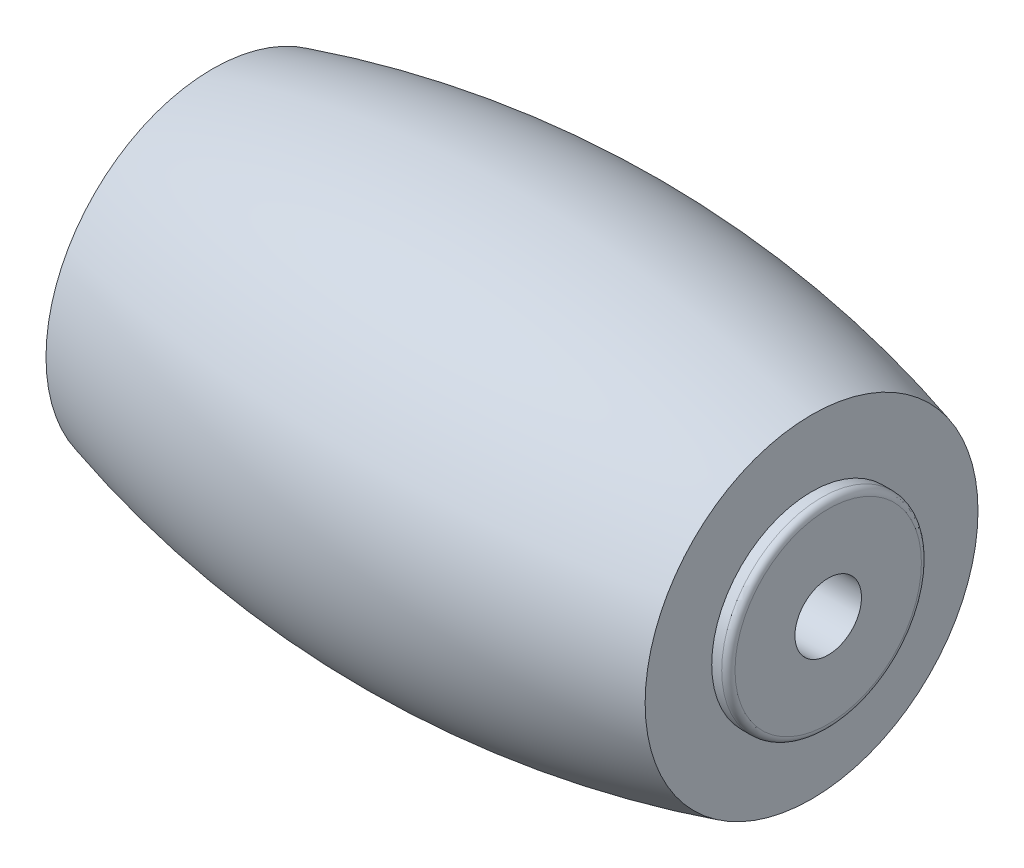
ISO-10303-21;
HEADER;
FILE_DESCRIPTION(('STEP AP214'),'2;1');
FILE_NAME('part.step','',(''),(''),'','','');
FILE_SCHEMA(('AUTOMOTIVE_DESIGN { 1 0 10303 214 1 1 1 1 }'));
ENDSEC;
DATA;
#1=APPLICATION_CONTEXT('core data for automotive mechanical design processes');
#2=APPLICATION_PROTOCOL_DEFINITION('international standard','automotive_design',2000,#1);
#3=PRODUCT_CONTEXT('',#1,'mechanical');
#4=PRODUCT('Part','Part','',(#3));
#5=PRODUCT_RELATED_PRODUCT_CATEGORY('part','',(#4));
#6=PRODUCT_DEFINITION_FORMATION('','',#4);
#7=PRODUCT_DEFINITION_CONTEXT('part definition',#1,'design');
#8=PRODUCT_DEFINITION('design','',#6,#7);
#9=PRODUCT_DEFINITION_SHAPE('','',#8);
#10=(LENGTH_UNIT() NAMED_UNIT(*) SI_UNIT(.MILLI.,.METRE.));
#11=(NAMED_UNIT(*) PLANE_ANGLE_UNIT() SI_UNIT($,.RADIAN.));
#12=(NAMED_UNIT(*) SI_UNIT($,.STERADIAN.) SOLID_ANGLE_UNIT());
#13=UNCERTAINTY_MEASURE_WITH_UNIT(LENGTH_MEASURE(1.E-05),#10,'distance_accuracy_value','');
#14=(GEOMETRIC_REPRESENTATION_CONTEXT(3) GLOBAL_UNCERTAINTY_ASSIGNED_CONTEXT((#13)) GLOBAL_UNIT_ASSIGNED_CONTEXT((#10,
#11,#12)) REPRESENTATION_CONTEXT('',''));
#15=CARTESIAN_POINT('',(0.,0.,0.));
#16=DIRECTION('',(0.,0.,1.));
#17=DIRECTION('',(1.,0.,0.));
#18=AXIS2_PLACEMENT_3D('',#15,#16,#17);
#19=CARTESIAN_POINT('',(8.05263157894736,0.,0.));
#20=DIRECTION('',(1.,0.,0.));
#21=DIRECTION('',(0.,0.,-1.));
#22=AXIS2_PLACEMENT_3D('',#19,#20,#21);
#23=PLANE('',#22);
#24=CARTESIAN_POINT('',(8.05263157894736,0.,0.));
#25=DIRECTION('',(1.,0.,0.));
#26=DIRECTION('',(0.,0.,-1.));
#27=AXIS2_PLACEMENT_3D('',#24,#25,#26);
#28=CIRCLE('',#27,2.68421052631579);
#29=CARTESIAN_POINT('',(8.05263157894736,0.,-2.68421052631579));
#30=VERTEX_POINT('',#29);
#31=EDGE_CURVE('E64',#30,#30,#28,.T.);
#32=ORIENTED_EDGE('',*,*,#31,.F.);
#33=EDGE_LOOP('',(#32));
#34=FACE_BOUND('',#33,.T.);
#35=CARTESIAN_POINT('',(8.05263157894735,0.,0.));
#36=DIRECTION('',(1.,0.,0.));
#37=DIRECTION('',(0.,0.,-1.));
#38=AXIS2_PLACEMENT_3D('',#35,#36,#37);
#39=CIRCLE('',#38,4.47368421052632);
#40=CARTESIAN_POINT('',(8.05263157894735,0.,-4.47368421052632));
#41=VERTEX_POINT('',#40);
#42=EDGE_CURVE('E69',#41,#41,#39,.T.);
#43=ORIENTED_EDGE('',*,*,#42,.T.);
#44=EDGE_LOOP('',(#43));
#45=FACE_BOUND('',#44,.T.);
#46=ADVANCED_FACE('F40',(#34,#45),#23,.T.);
#47=CARTESIAN_POINT('',(-8.05263157894737,0.,0.));
#48=DIRECTION('',(-1.,0.,0.));
#49=DIRECTION('',(0.,0.,1.));
#50=AXIS2_PLACEMENT_3D('',#47,#48,#49);
#51=PLANE('',#50);
#52=CARTESIAN_POINT('',(-8.05263157894736,0.,0.));
#53=DIRECTION('',(1.,0.,0.));
#54=DIRECTION('',(0.,0.,-1.));
#55=AXIS2_PLACEMENT_3D('',#52,#53,#54);
#56=CIRCLE('',#55,2.68421052631579);
#57=CARTESIAN_POINT('',(-8.05263157894736,0.,-2.68421052631579));
#58=VERTEX_POINT('',#57);
#59=EDGE_CURVE('E73',#58,#58,#56,.T.);
#60=ORIENTED_EDGE('',*,*,#59,.T.);
#61=EDGE_LOOP('',(#60));
#62=FACE_BOUND('',#61,.T.);
#63=CARTESIAN_POINT('',(-8.05263157894737,0.,0.));
#64=DIRECTION('',(1.,0.,0.));
#65=DIRECTION('',(0.,0.,-1.));
#66=AXIS2_PLACEMENT_3D('',#63,#64,#65);
#67=CIRCLE('',#66,4.47368421052632);
#68=CARTESIAN_POINT('',(-8.05263157894737,0.,-4.47368421052632));
#69=VERTEX_POINT('',#68);
#70=EDGE_CURVE('E65',#69,#69,#67,.T.);
#71=ORIENTED_EDGE('',*,*,#70,.F.);
#72=EDGE_LOOP('',(#71));
#73=FACE_BOUND('',#72,.T.);
#74=ADVANCED_FACE('F107',(#62,#73),#51,.T.);
#75=CARTESIAN_POINT('',(0.,0.,0.));
#76=DIRECTION('',(1.,0.,0.));
#77=DIRECTION('',(0.,0.,-1.));
#78=AXIS2_PLACEMENT_3D('',#75,#76,#77);
#79=DEGENERATE_TOROIDAL_SURFACE('',#78,23.9643137300933,29.5561263060122,.F.);
#80=ORIENTED_EDGE('',*,*,#70,.T.);
#81=EDGE_LOOP('',(#80));
#82=FACE_BOUND('',#81,.T.);
#83=ORIENTED_EDGE('',*,*,#42,.F.);
#84=EDGE_LOOP('',(#83));
#85=FACE_BOUND('',#84,.T.);
#86=ADVANCED_FACE('F113',(#82,#85),#79,.F.);
#87=CARTESIAN_POINT('',(8.49999999999999,0.,0.));
#88=DIRECTION('',(-1.,0.,0.));
#89=DIRECTION('',(0.,0.,1.));
#90=AXIS2_PLACEMENT_3D('',#87,#88,#89);
#91=CYLINDRICAL_SURFACE('',#90,2.68421052631579);
#92=CARTESIAN_POINT('',(8.32105263157894,0.,0.));
#93=DIRECTION('',(1.,0.,0.));
#94=DIRECTION('',(0.,0.,-1.));
#95=AXIS2_PLACEMENT_3D('',#92,#93,#94);
#96=CIRCLE('',#95,2.68421052631579);
#97=CARTESIAN_POINT('',(8.32105263157894,0.,-2.68421052631579));
#98=VERTEX_POINT('',#97);
#99=EDGE_CURVE('E53',#98,#98,#96,.F.);
#100=ORIENTED_EDGE('',*,*,#99,.T.);
#101=EDGE_LOOP('',(#100));
#102=FACE_BOUND('',#101,.T.);
#103=ORIENTED_EDGE('',*,*,#31,.T.);
#104=EDGE_LOOP('',(#103));
#105=FACE_BOUND('',#104,.T.);
#106=ADVANCED_FACE('F130',(#102,#105),#91,.T.);
#107=CARTESIAN_POINT('',(8.49999999999999,0.,0.));
#108=DIRECTION('',(1.,0.,0.));
#109=DIRECTION('',(0.,0.,-1.));
#110=AXIS2_PLACEMENT_3D('',#107,#108,#109);
#111=PLANE('',#110);
#112=CARTESIAN_POINT('',(8.49999999999999,0.,0.));
#113=DIRECTION('',(1.,0.,0.));
#114=DIRECTION('',(0.,0.,-1.));
#115=AXIS2_PLACEMENT_3D('',#112,#113,#114);
#116=CIRCLE('',#115,2.50526315789474);
#117=CARTESIAN_POINT('',(8.49999999999999,0.,-2.50526315789474));
#118=VERTEX_POINT('',#117);
#119=EDGE_CURVE('E58',#118,#118,#116,.T.);
#120=ORIENTED_EDGE('',*,*,#119,.T.);
#121=EDGE_LOOP('',(#120));
#122=FACE_BOUND('',#121,.T.);
#123=CARTESIAN_POINT('',(8.49999999999999,0.,0.));
#124=DIRECTION('',(-1.,0.,0.));
#125=DIRECTION('',(0.,0.,1.));
#126=AXIS2_PLACEMENT_3D('',#123,#124,#125);
#127=CIRCLE('',#126,0.894736842105263);
#128=CARTESIAN_POINT('',(8.49999999999999,0.,0.894736842105263));
#129=VERTEX_POINT('',#128);
#130=EDGE_CURVE('E80',#129,#129,#127,.T.);
#131=ORIENTED_EDGE('',*,*,#130,.T.);
#132=EDGE_LOOP('',(#131));
#133=FACE_BOUND('',#132,.T.);
#134=ADVANCED_FACE('F89',(#122,#133),#111,.T.);
#135=CARTESIAN_POINT('',(-8.49999999999999,0.,0.));
#136=DIRECTION('',(1.,0.,0.));
#137=DIRECTION('',(0.,0.,-1.));
#138=AXIS2_PLACEMENT_3D('',#135,#136,#137);
#139=CYLINDRICAL_SURFACE('',#138,2.68421052631579);
#140=CARTESIAN_POINT('',(-8.32105263157894,0.,0.));
#141=DIRECTION('',(-1.,0.,0.));
#142=DIRECTION('',(0.,0.,1.));
#143=AXIS2_PLACEMENT_3D('',#140,#141,#142);
#144=CIRCLE('',#143,2.68421052631579);
#145=CARTESIAN_POINT('',(-8.32105263157894,0.,2.68421052631579));
#146=VERTEX_POINT('',#145);
#147=EDGE_CURVE('E48',#146,#146,#144,.F.);
#148=ORIENTED_EDGE('',*,*,#147,.T.);
#149=EDGE_LOOP('',(#148));
#150=FACE_BOUND('',#149,.T.);
#151=ORIENTED_EDGE('',*,*,#59,.F.);
#152=EDGE_LOOP('',(#151));
#153=FACE_BOUND('',#152,.T.);
#154=ADVANCED_FACE('F100',(#150,#153),#139,.T.);
#155=CARTESIAN_POINT('',(-8.49999999999999,0.,0.));
#156=DIRECTION('',(-1.,0.,0.));
#157=DIRECTION('',(0.,0.,-1.));
#158=AXIS2_PLACEMENT_3D('',#155,#156,#157);
#159=PLANE('',#158);
#160=CARTESIAN_POINT('',(-8.49999999999999,0.,0.));
#161=DIRECTION('',(-1.,0.,0.));
#162=DIRECTION('',(0.,0.,1.));
#163=AXIS2_PLACEMENT_3D('',#160,#161,#162);
#164=CIRCLE('',#163,2.50526315789474);
#165=CARTESIAN_POINT('',(-8.49999999999999,0.,2.50526315789474));
#166=VERTEX_POINT('',#165);
#167=EDGE_CURVE('E10',#166,#166,#164,.T.);
#168=ORIENTED_EDGE('',*,*,#167,.T.);
#169=EDGE_LOOP('',(#168));
#170=FACE_BOUND('',#169,.T.);
#171=CARTESIAN_POINT('',(-8.49999999999999,0.,0.));
#172=DIRECTION('',(-1.,0.,0.));
#173=DIRECTION('',(0.,0.,1.));
#174=AXIS2_PLACEMENT_3D('',#171,#172,#173);
#175=CIRCLE('',#174,0.894736842105263);
#176=CARTESIAN_POINT('',(-8.49999999999999,0.,0.894736842105263));
#177=VERTEX_POINT('',#176);
#178=EDGE_CURVE('E81',#177,#177,#175,.T.);
#179=ORIENTED_EDGE('',*,*,#178,.F.);
#180=EDGE_LOOP('',(#179));
#181=FACE_BOUND('',#180,.T.);
#182=ADVANCED_FACE('F95',(#170,#181),#159,.T.);
#183=CARTESIAN_POINT('',(8.49999999999999,0.,0.));
#184=DIRECTION('',(-1.,0.,0.));
#185=DIRECTION('',(0.,0.,1.));
#186=AXIS2_PLACEMENT_3D('',#183,#184,#185);
#187=CYLINDRICAL_SURFACE('',#186,0.894736842105263);
#188=ORIENTED_EDGE('',*,*,#130,.F.);
#189=EDGE_LOOP('',(#188));
#190=FACE_BOUND('',#189,.T.);
#191=ORIENTED_EDGE('',*,*,#178,.T.);
#192=EDGE_LOOP('',(#191));
#193=FACE_BOUND('',#192,.T.);
#194=ADVANCED_FACE('F91',(#190,#193),#187,.F.);
#195=CARTESIAN_POINT('',(8.32105263157894,0.,0.));
#196=DIRECTION('',(1.,0.,0.));
#197=DIRECTION('',(0.,0.,-1.));
#198=AXIS2_PLACEMENT_3D('',#195,#196,#197);
#199=TOROIDAL_SURFACE('',#198,2.50526315789474,0.178947368421053);
#200=ORIENTED_EDGE('',*,*,#99,.F.);
#201=EDGE_LOOP('',(#200));
#202=FACE_BOUND('',#201,.T.);
#203=ORIENTED_EDGE('',*,*,#119,.F.);
#204=EDGE_LOOP('',(#203));
#205=FACE_BOUND('',#204,.T.);
#206=ADVANCED_FACE('F94',(#202,#205),#199,.T.);
#207=CARTESIAN_POINT('',(-8.32105263157894,0.,0.));
#208=DIRECTION('',(-1.,0.,0.));
#209=DIRECTION('',(0.,0.,1.));
#210=AXIS2_PLACEMENT_3D('',#207,#208,#209);
#211=TOROIDAL_SURFACE('',#210,2.50526315789474,0.178947368421053);
#212=ORIENTED_EDGE('',*,*,#167,.F.);
#213=EDGE_LOOP('',(#212));
#214=FACE_BOUND('',#213,.T.);
#215=ORIENTED_EDGE('',*,*,#147,.F.);
#216=EDGE_LOOP('',(#215));
#217=FACE_BOUND('',#216,.T.);
#218=ADVANCED_FACE('F42',(#214,#217),#211,.T.);
#219=CLOSED_SHELL('',(#46,#74,#86,#106,#134,#154,#182,#194,#206,#218));
#220=MANIFOLD_SOLID_BREP('B2',#219);
#221=ADVANCED_BREP_SHAPE_REPRESENTATION('',(#18,#220),#14);
#222=SHAPE_DEFINITION_REPRESENTATION(#9,#221);
ENDSEC;
END-ISO-10303-21;
